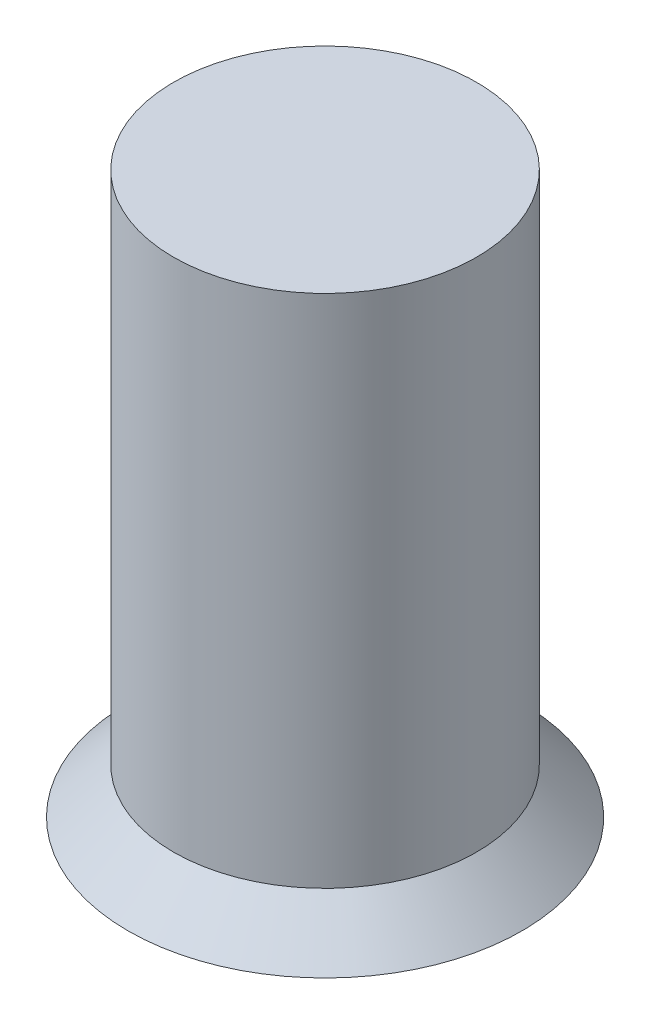
ISO-10303-21;
HEADER;
FILE_DESCRIPTION(('STEP AP214'),'2;1');
FILE_NAME('part.step','',(''),(''),'','','');
FILE_SCHEMA(('AUTOMOTIVE_DESIGN { 1 0 10303 214 1 1 1 1 }'));
ENDSEC;
DATA;
#1=APPLICATION_CONTEXT('core data for automotive mechanical design processes');
#2=APPLICATION_PROTOCOL_DEFINITION('international standard','automotive_design',2000,#1);
#3=PRODUCT_CONTEXT('',#1,'mechanical');
#4=PRODUCT('Part','Part','',(#3));
#5=PRODUCT_RELATED_PRODUCT_CATEGORY('part','',(#4));
#6=PRODUCT_DEFINITION_FORMATION('','',#4);
#7=PRODUCT_DEFINITION_CONTEXT('part definition',#1,'design');
#8=PRODUCT_DEFINITION('design','',#6,#7);
#9=PRODUCT_DEFINITION_SHAPE('','',#8);
#10=(LENGTH_UNIT() NAMED_UNIT(*) SI_UNIT(.MILLI.,.METRE.));
#11=(NAMED_UNIT(*) PLANE_ANGLE_UNIT() SI_UNIT($,.RADIAN.));
#12=(NAMED_UNIT(*) SI_UNIT($,.STERADIAN.) SOLID_ANGLE_UNIT());
#13=UNCERTAINTY_MEASURE_WITH_UNIT(LENGTH_MEASURE(1.E-05),#10,'distance_accuracy_value','');
#14=(GEOMETRIC_REPRESENTATION_CONTEXT(3) GLOBAL_UNCERTAINTY_ASSIGNED_CONTEXT((#13)) GLOBAL_UNIT_ASSIGNED_CONTEXT((#10,
#11,#12)) REPRESENTATION_CONTEXT('',''));
#15=CARTESIAN_POINT('',(0.,0.,0.));
#16=DIRECTION('',(0.,0.,1.));
#17=DIRECTION('',(1.,0.,0.));
#18=AXIS2_PLACEMENT_3D('',#15,#16,#17);
#19=CARTESIAN_POINT('',(0.,0.,0.));
#20=DIRECTION('',(0.,1.,0.));
#21=DIRECTION('',(0.,0.,1.));
#22=AXIS2_PLACEMENT_3D('',#19,#20,#21);
#23=PLANE('',#22);
#24=CARTESIAN_POINT('',(0.,0.,0.));
#25=DIRECTION('',(0.,1.,0.));
#26=DIRECTION('',(0.,0.,1.));
#27=AXIS2_PLACEMENT_3D('',#24,#25,#26);
#28=CIRCLE('',#27,13.);
#29=CARTESIAN_POINT('',(0.,0.,13.));
#30=VERTEX_POINT('',#29);
#31=EDGE_CURVE('E38',#30,#30,#28,.T.);
#32=ORIENTED_EDGE('',*,*,#31,.F.);
#33=EDGE_LOOP('',(#32));
#34=FACE_BOUND('',#33,.T.);
#35=ADVANCED_FACE('F31',(#34),#23,.F.);
#36=CARTESIAN_POINT('',(0.,3.,0.));
#37=DIRECTION('',(0.,-1.,0.));
#38=DIRECTION('',(0.,0.,-1.));
#39=AXIS2_PLACEMENT_3D('',#36,#37,#38);
#40=CONICAL_SURFACE('',#39,10.,0.785398163397447);
#41=ORIENTED_EDGE('',*,*,#31,.T.);
#42=EDGE_LOOP('',(#41));
#43=FACE_BOUND('',#42,.T.);
#44=CARTESIAN_POINT('',(0.,3.,0.));
#45=DIRECTION('',(0.,1.,0.));
#46=DIRECTION('',(0.,0.,1.));
#47=AXIS2_PLACEMENT_3D('',#44,#45,#46);
#48=CIRCLE('',#47,10.);
#49=CARTESIAN_POINT('',(0.,3.,10.));
#50=VERTEX_POINT('',#49);
#51=EDGE_CURVE('E10',#50,#50,#48,.T.);
#52=ORIENTED_EDGE('',*,*,#51,.F.);
#53=EDGE_LOOP('',(#52));
#54=FACE_BOUND('',#53,.T.);
#55=ADVANCED_FACE('F33',(#43,#54),#40,.T.);
#56=CARTESIAN_POINT('',(0.,37.,0.));
#57=DIRECTION('',(0.,-1.,0.));
#58=DIRECTION('',(0.,0.,-1.));
#59=AXIS2_PLACEMENT_3D('',#56,#57,#58);
#60=CYLINDRICAL_SURFACE('',#59,10.);
#61=CARTESIAN_POINT('',(0.,37.,0.));
#62=DIRECTION('',(0.,1.,0.));
#63=DIRECTION('',(0.,0.,1.));
#64=AXIS2_PLACEMENT_3D('',#61,#62,#63);
#65=CIRCLE('',#64,10.);
#66=CARTESIAN_POINT('',(0.,37.,10.));
#67=VERTEX_POINT('',#66);
#68=EDGE_CURVE('E42',#67,#67,#65,.T.);
#69=ORIENTED_EDGE('',*,*,#68,.F.);
#70=EDGE_LOOP('',(#69));
#71=FACE_BOUND('',#70,.T.);
#72=ORIENTED_EDGE('',*,*,#51,.T.);
#73=EDGE_LOOP('',(#72));
#74=FACE_BOUND('',#73,.T.);
#75=ADVANCED_FACE('F51',(#71,#74),#60,.T.);
#76=CARTESIAN_POINT('',(0.,37.,0.));
#77=DIRECTION('',(0.,1.,0.));
#78=DIRECTION('',(0.,0.,1.));
#79=AXIS2_PLACEMENT_3D('',#76,#77,#78);
#80=PLANE('',#79);
#81=ORIENTED_EDGE('',*,*,#68,.T.);
#82=EDGE_LOOP('',(#81));
#83=FACE_BOUND('',#82,.T.);
#84=ADVANCED_FACE('F49',(#83),#80,.T.);
#85=CLOSED_SHELL('',(#35,#55,#75,#84));
#86=MANIFOLD_SOLID_BREP('B2',#85);
#87=ADVANCED_BREP_SHAPE_REPRESENTATION('',(#18,#86),#14);
#88=SHAPE_DEFINITION_REPRESENTATION(#9,#87);
ENDSEC;
END-ISO-10303-21;
